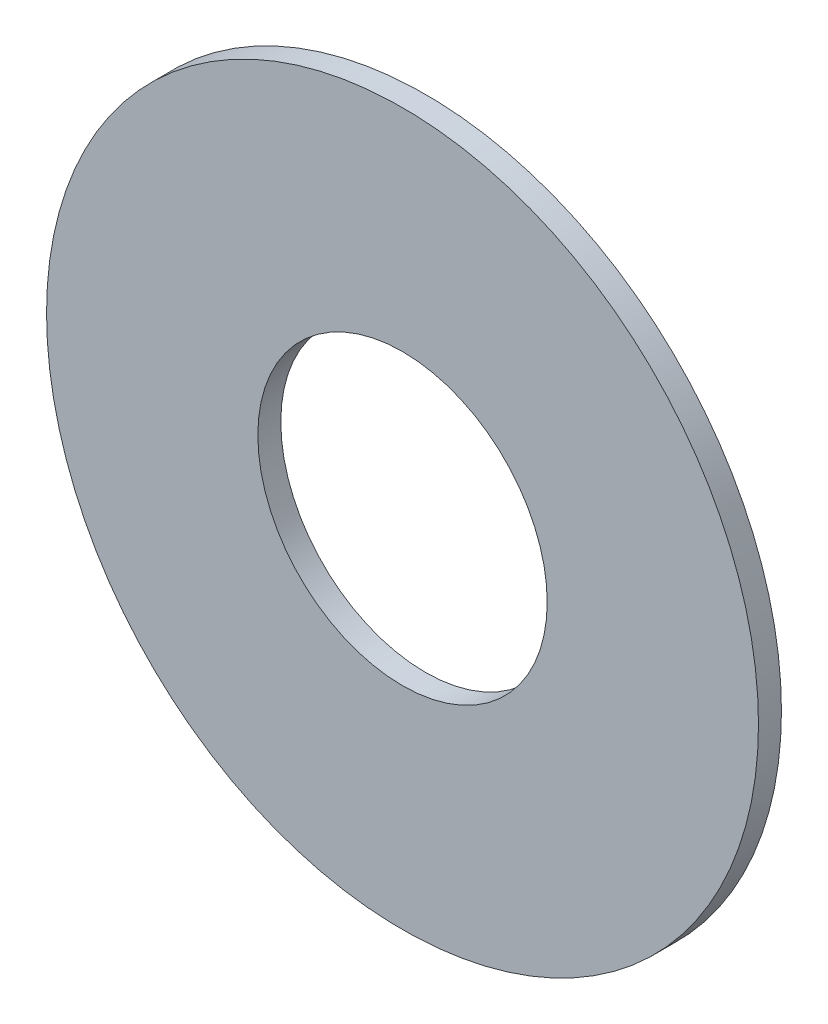
ISO-10303-21;
HEADER;
FILE_DESCRIPTION(('STEP AP214'),'2;1');
FILE_NAME('part.step','',(''),(''),'','','');
FILE_SCHEMA(('AUTOMOTIVE_DESIGN { 1 0 10303 214 1 1 1 1 }'));
ENDSEC;
DATA;
#1=APPLICATION_CONTEXT('core data for automotive mechanical design processes');
#2=APPLICATION_PROTOCOL_DEFINITION('international standard','automotive_design',2000,#1);
#3=PRODUCT_CONTEXT('',#1,'mechanical');
#4=PRODUCT('Part','Part','',(#3));
#5=PRODUCT_RELATED_PRODUCT_CATEGORY('part','',(#4));
#6=PRODUCT_DEFINITION_FORMATION('','',#4);
#7=PRODUCT_DEFINITION_CONTEXT('part definition',#1,'design');
#8=PRODUCT_DEFINITION('design','',#6,#7);
#9=PRODUCT_DEFINITION_SHAPE('','',#8);
#10=(LENGTH_UNIT() NAMED_UNIT(*) SI_UNIT(.MILLI.,.METRE.));
#11=(NAMED_UNIT(*) PLANE_ANGLE_UNIT() SI_UNIT($,.RADIAN.));
#12=(NAMED_UNIT(*) SI_UNIT($,.STERADIAN.) SOLID_ANGLE_UNIT());
#13=UNCERTAINTY_MEASURE_WITH_UNIT(LENGTH_MEASURE(1.E-05),#10,'distance_accuracy_value','');
#14=(GEOMETRIC_REPRESENTATION_CONTEXT(3) GLOBAL_UNCERTAINTY_ASSIGNED_CONTEXT((#13)) GLOBAL_UNIT_ASSIGNED_CONTEXT((#10,
#11,#12)) REPRESENTATION_CONTEXT('',''));
#15=CARTESIAN_POINT('',(0.,0.,0.));
#16=DIRECTION('',(0.,0.,1.));
#17=DIRECTION('',(1.,0.,0.));
#18=AXIS2_PLACEMENT_3D('',#15,#16,#17);
#19=CARTESIAN_POINT('',(0.,0.,0.254));
#20=DIRECTION('',(0.,0.,1.));
#21=DIRECTION('',(1.,0.,0.));
#22=AXIS2_PLACEMENT_3D('',#19,#20,#21);
#23=PLANE('',#22);
#24=CARTESIAN_POINT('',(0.,0.,0.254));
#25=DIRECTION('',(0.,0.,1.));
#26=DIRECTION('',(1.,0.,0.));
#27=AXIS2_PLACEMENT_3D('',#24,#25,#26);
#28=CIRCLE('',#27,3.937);
#29=CARTESIAN_POINT('',(3.937,0.,0.254));
#30=VERTEX_POINT('',#29);
#31=EDGE_CURVE('E10',#30,#30,#28,.T.);
#32=ORIENTED_EDGE('',*,*,#31,.T.);
#33=EDGE_LOOP('',(#32));
#34=FACE_BOUND('',#33,.T.);
#35=CARTESIAN_POINT('',(0.,0.,0.254));
#36=DIRECTION('',(0.,0.,1.));
#37=DIRECTION('',(1.,0.,0.));
#38=AXIS2_PLACEMENT_3D('',#35,#36,#37);
#39=CIRCLE('',#38,1.6002);
#40=CARTESIAN_POINT('',(1.6002,0.,0.254));
#41=VERTEX_POINT('',#40);
#42=EDGE_CURVE('E50',#41,#41,#39,.T.);
#43=ORIENTED_EDGE('',*,*,#42,.F.);
#44=EDGE_LOOP('',(#43));
#45=FACE_BOUND('',#44,.T.);
#46=ADVANCED_FACE('F37',(#34,#45),#23,.T.);
#47=CARTESIAN_POINT('',(0.,0.,0.));
#48=DIRECTION('',(0.,0.,1.));
#49=DIRECTION('',(1.,0.,0.));
#50=AXIS2_PLACEMENT_3D('',#47,#48,#49);
#51=PLANE('',#50);
#52=CARTESIAN_POINT('',(0.,0.,0.));
#53=DIRECTION('',(0.,0.,1.));
#54=DIRECTION('',(1.,0.,0.));
#55=AXIS2_PLACEMENT_3D('',#52,#53,#54);
#56=CIRCLE('',#55,3.937);
#57=CARTESIAN_POINT('',(3.937,0.,0.));
#58=VERTEX_POINT('',#57);
#59=EDGE_CURVE('E41',#58,#58,#56,.T.);
#60=ORIENTED_EDGE('',*,*,#59,.F.);
#61=EDGE_LOOP('',(#60));
#62=FACE_BOUND('',#61,.T.);
#63=CARTESIAN_POINT('',(0.,0.,0.));
#64=DIRECTION('',(0.,0.,1.));
#65=DIRECTION('',(1.,0.,0.));
#66=AXIS2_PLACEMENT_3D('',#63,#64,#65);
#67=CIRCLE('',#66,1.6002);
#68=CARTESIAN_POINT('',(1.6002,0.,0.));
#69=VERTEX_POINT('',#68);
#70=EDGE_CURVE('E52',#69,#69,#67,.T.);
#71=ORIENTED_EDGE('',*,*,#70,.T.);
#72=EDGE_LOOP('',(#71));
#73=FACE_BOUND('',#72,.T.);
#74=ADVANCED_FACE('F64',(#62,#73),#51,.F.);
#75=CARTESIAN_POINT('',(0.,0.,0.254));
#76=DIRECTION('',(0.,0.,-1.));
#77=DIRECTION('',(-1.,0.,0.));
#78=AXIS2_PLACEMENT_3D('',#75,#76,#77);
#79=CYLINDRICAL_SURFACE('',#78,3.937);
#80=ORIENTED_EDGE('',*,*,#31,.F.);
#81=EDGE_LOOP('',(#80));
#82=FACE_BOUND('',#81,.T.);
#83=ORIENTED_EDGE('',*,*,#59,.T.);
#84=EDGE_LOOP('',(#83));
#85=FACE_BOUND('',#84,.T.);
#86=ADVANCED_FACE('F39',(#82,#85),#79,.T.);
#87=CARTESIAN_POINT('',(0.,0.,0.254));
#88=DIRECTION('',(0.,0.,-1.));
#89=DIRECTION('',(-1.,0.,0.));
#90=AXIS2_PLACEMENT_3D('',#87,#88,#89);
#91=CYLINDRICAL_SURFACE('',#90,1.6002);
#92=ORIENTED_EDGE('',*,*,#42,.T.);
#93=EDGE_LOOP('',(#92));
#94=FACE_BOUND('',#93,.T.);
#95=ORIENTED_EDGE('',*,*,#70,.F.);
#96=EDGE_LOOP('',(#95));
#97=FACE_BOUND('',#96,.T.);
#98=ADVANCED_FACE('F60',(#94,#97),#91,.F.);
#99=CLOSED_SHELL('',(#46,#74,#86,#98));
#100=MANIFOLD_SOLID_BREP('B2',#99);
#101=ADVANCED_BREP_SHAPE_REPRESENTATION('',(#18,#100),#14);
#102=SHAPE_DEFINITION_REPRESENTATION(#9,#101);
ENDSEC;
END-ISO-10303-21;
